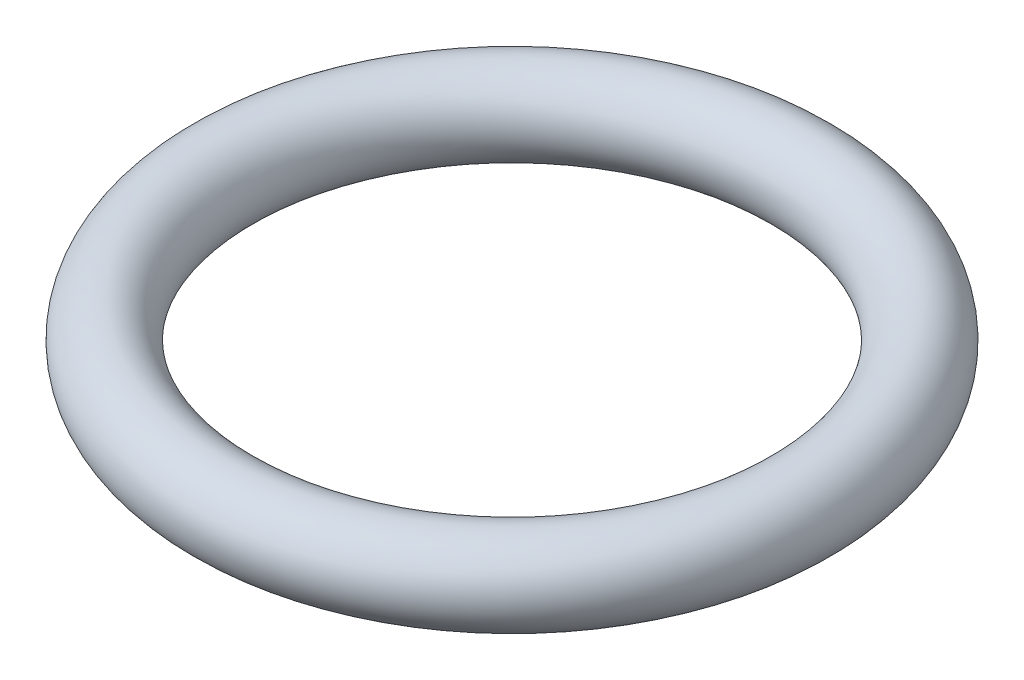
ISO-10303-21;
HEADER;
FILE_DESCRIPTION(('STEP AP214'),'2;1');
FILE_NAME('part.step','',(''),(''),'','','');
FILE_SCHEMA(('AUTOMOTIVE_DESIGN { 1 0 10303 214 1 1 1 1 }'));
ENDSEC;
DATA;
#1=APPLICATION_CONTEXT('core data for automotive mechanical design processes');
#2=APPLICATION_PROTOCOL_DEFINITION('international standard','automotive_design',2000,#1);
#3=PRODUCT_CONTEXT('',#1,'mechanical');
#4=PRODUCT('Part','Part','',(#3));
#5=PRODUCT_RELATED_PRODUCT_CATEGORY('part','',(#4));
#6=PRODUCT_DEFINITION_FORMATION('','',#4);
#7=PRODUCT_DEFINITION_CONTEXT('part definition',#1,'design');
#8=PRODUCT_DEFINITION('design','',#6,#7);
#9=PRODUCT_DEFINITION_SHAPE('','',#8);
#10=(LENGTH_UNIT() NAMED_UNIT(*) SI_UNIT(.MILLI.,.METRE.));
#11=(NAMED_UNIT(*) PLANE_ANGLE_UNIT() SI_UNIT($,.RADIAN.));
#12=(NAMED_UNIT(*) SI_UNIT($,.STERADIAN.) SOLID_ANGLE_UNIT());
#13=UNCERTAINTY_MEASURE_WITH_UNIT(LENGTH_MEASURE(1.E-05),#10,'distance_accuracy_value','');
#14=(GEOMETRIC_REPRESENTATION_CONTEXT(3) GLOBAL_UNCERTAINTY_ASSIGNED_CONTEXT((#13)) GLOBAL_UNIT_ASSIGNED_CONTEXT((#10,
#11,#12)) REPRESENTATION_CONTEXT('',''));
#15=CARTESIAN_POINT('',(0.,0.,0.));
#16=DIRECTION('',(0.,0.,1.));
#17=DIRECTION('',(1.,0.,0.));
#18=AXIS2_PLACEMENT_3D('',#15,#16,#17);
#19=CARTESIAN_POINT('',(0.,0.,0.));
#20=DIRECTION('',(0.,-1.,0.));
#21=DIRECTION('',(0.,0.,-1.));
#22=AXIS2_PLACEMENT_3D('',#19,#20,#21);
#23=TOROIDAL_SURFACE('',#22,5.55625,0.79375);
#24=CARTESIAN_POINT('',(0.,0.,-6.35));
#25=VERTEX_POINT('',#24);
#26=VERTEX_LOOP('',#25);
#27=FACE_BOUND('',#26,.T.);
#28=ADVANCED_FACE('F26',(#27),#23,.T.);
#29=CLOSED_SHELL('',(#28));
#30=MANIFOLD_SOLID_BREP('B2',#29);
#31=ADVANCED_BREP_SHAPE_REPRESENTATION('',(#18,#30),#14);
#32=SHAPE_DEFINITION_REPRESENTATION(#9,#31);
ENDSEC;
END-ISO-10303-21;
